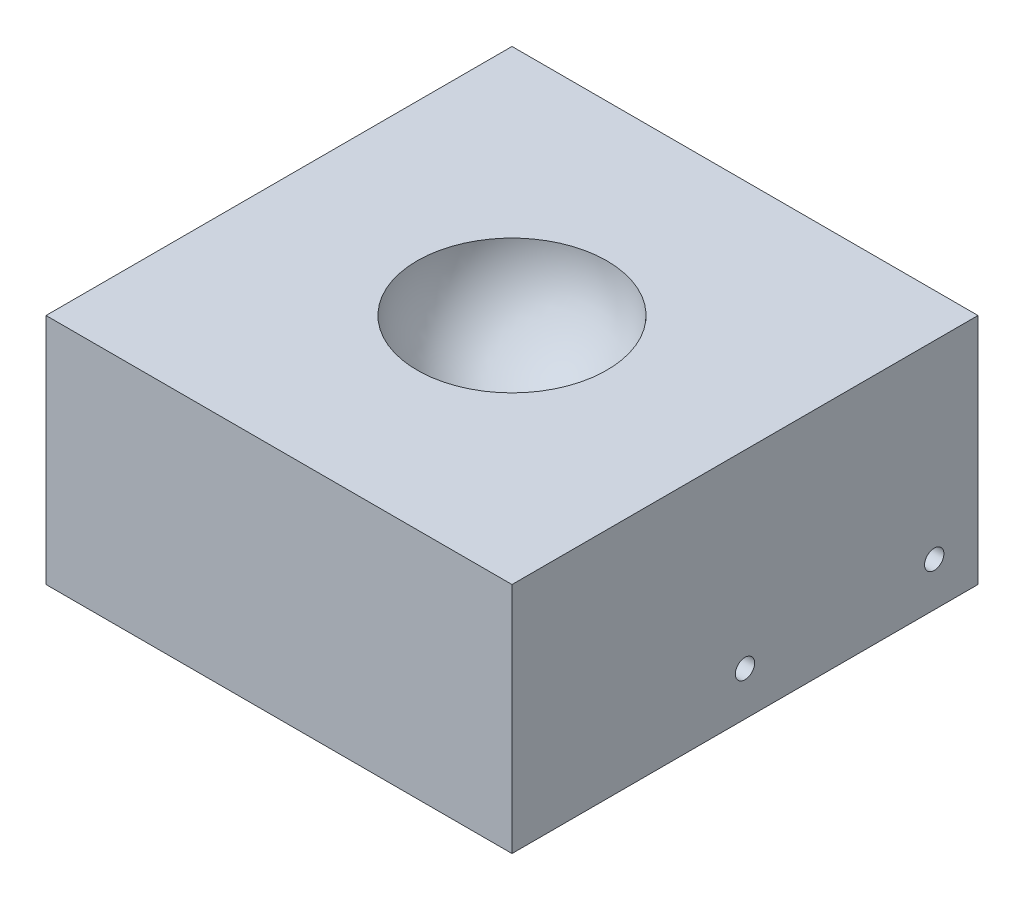
ISO-10303-21;
HEADER;
FILE_DESCRIPTION(('STEP AP214'),'2;1');
FILE_NAME('part.step','',(''),(''),'','','');
FILE_SCHEMA(('AUTOMOTIVE_DESIGN { 1 0 10303 214 1 1 1 1 }'));
ENDSEC;
DATA;
#1=APPLICATION_CONTEXT('core data for automotive mechanical design processes');
#2=APPLICATION_PROTOCOL_DEFINITION('international standard','automotive_design',2000,#1);
#3=PRODUCT_CONTEXT('',#1,'mechanical');
#4=PRODUCT('Part','Part','',(#3));
#5=PRODUCT_RELATED_PRODUCT_CATEGORY('part','',(#4));
#6=PRODUCT_DEFINITION_FORMATION('','',#4);
#7=PRODUCT_DEFINITION_CONTEXT('part definition',#1,'design');
#8=PRODUCT_DEFINITION('design','',#6,#7);
#9=PRODUCT_DEFINITION_SHAPE('','',#8);
#10=(LENGTH_UNIT() NAMED_UNIT(*) SI_UNIT(.MILLI.,.METRE.));
#11=(NAMED_UNIT(*) PLANE_ANGLE_UNIT() SI_UNIT($,.RADIAN.));
#12=(NAMED_UNIT(*) SI_UNIT($,.STERADIAN.) SOLID_ANGLE_UNIT());
#13=UNCERTAINTY_MEASURE_WITH_UNIT(LENGTH_MEASURE(1.E-05),#10,'distance_accuracy_value','');
#14=(GEOMETRIC_REPRESENTATION_CONTEXT(3) GLOBAL_UNCERTAINTY_ASSIGNED_CONTEXT((#13)) GLOBAL_UNIT_ASSIGNED_CONTEXT((#10,
#11,#12)) REPRESENTATION_CONTEXT('',''));
#15=CARTESIAN_POINT('',(0.,0.,0.));
#16=DIRECTION('',(0.,0.,1.));
#17=DIRECTION('',(1.,0.,0.));
#18=AXIS2_PLACEMENT_3D('',#15,#16,#17);
#19=CARTESIAN_POINT('',(86.,-86.,86.));
#20=DIRECTION('',(1.,0.,0.));
#21=DIRECTION('',(0.,0.,-1.));
#22=AXIS2_PLACEMENT_3D('',#19,#20,#21);
#23=PLANE('',#22);
#24=CARTESIAN_POINT('',(86.,-69.85,-69.85));
#25=DIRECTION('',(1.,0.,0.));
#26=DIRECTION('',(0.,0.,-1.));
#27=AXIS2_PLACEMENT_3D('',#24,#25,#26);
#28=CIRCLE('',#27,3.56870000000001);
#29=CARTESIAN_POINT('',(86.,-69.85,-73.4187));
#30=VERTEX_POINT('',#29);
#31=EDGE_CURVE('E150',#30,#30,#28,.T.);
#32=ORIENTED_EDGE('',*,*,#31,.F.);
#33=EDGE_LOOP('',(#32));
#34=FACE_BOUND('',#33,.T.);
#35=CARTESIAN_POINT('',(86.,-69.85,0.));
#36=DIRECTION('',(1.,0.,0.));
#37=DIRECTION('',(0.,0.,-1.));
#38=AXIS2_PLACEMENT_3D('',#35,#36,#37);
#39=CIRCLE('',#38,3.56870000000001);
#40=CARTESIAN_POINT('',(86.,-69.85,-3.56870000000001));
#41=VERTEX_POINT('',#40);
#42=EDGE_CURVE('E152',#41,#41,#39,.T.);
#43=ORIENTED_EDGE('',*,*,#42,.F.);
#44=EDGE_LOOP('',(#43));
#45=FACE_BOUND('',#44,.T.);
#46=DIRECTION('',(0.,0.,-1.));
#47=VECTOR('',#46,1.);
#48=CARTESIAN_POINT('',(86.,0.,86.));
#49=LINE('',#48,#47);
#50=CARTESIAN_POINT('',(86.,0.,86.));
#51=VERTEX_POINT('',#50);
#52=CARTESIAN_POINT('',(86.,0.,-86.));
#53=VERTEX_POINT('',#52);
#54=EDGE_CURVE('E97',#51,#53,#49,.T.);
#55=ORIENTED_EDGE('',*,*,#54,.F.);
#56=DIRECTION('',(0.,1.,0.));
#57=VECTOR('',#56,1.);
#58=CARTESIAN_POINT('',(86.,-86.,86.));
#59=LINE('',#58,#57);
#60=CARTESIAN_POINT('',(86.,-86.,86.));
#61=VERTEX_POINT('',#60);
#62=EDGE_CURVE('E11',#61,#51,#59,.T.);
#63=ORIENTED_EDGE('',*,*,#62,.F.);
#64=DIRECTION('',(0.,0.,-1.));
#65=VECTOR('',#64,1.);
#66=CARTESIAN_POINT('',(86.,-86.,86.));
#67=LINE('',#66,#65);
#68=CARTESIAN_POINT('',(86.,-86.,-86.));
#69=VERTEX_POINT('',#68);
#70=EDGE_CURVE('E90',#61,#69,#67,.T.);
#71=ORIENTED_EDGE('',*,*,#70,.T.);
#72=DIRECTION('',(0.,1.,0.));
#73=VECTOR('',#72,1.);
#74=CARTESIAN_POINT('',(86.,-86.,-86.));
#75=LINE('',#74,#73);
#76=EDGE_CURVE('E35',#69,#53,#75,.T.);
#77=ORIENTED_EDGE('',*,*,#76,.T.);
#78=EDGE_LOOP('',(#55,#63,#71,#77));
#79=FACE_BOUND('',#78,.T.);
#80=ADVANCED_FACE('F32',(#34,#45,#79),#23,.T.);
#81=CARTESIAN_POINT('',(-86.,-86.,86.));
#82=DIRECTION('',(0.,0.,1.));
#83=DIRECTION('',(1.,0.,0.));
#84=AXIS2_PLACEMENT_3D('',#81,#82,#83);
#85=PLANE('',#84);
#86=DIRECTION('',(1.,0.,0.));
#87=VECTOR('',#86,1.);
#88=CARTESIAN_POINT('',(-86.,0.,86.));
#89=LINE('',#88,#87);
#90=CARTESIAN_POINT('',(-86.,0.,86.));
#91=VERTEX_POINT('',#90);
#92=EDGE_CURVE('E92',#91,#51,#89,.T.);
#93=ORIENTED_EDGE('',*,*,#92,.F.);
#94=DIRECTION('',(0.,1.,0.));
#95=VECTOR('',#94,1.);
#96=CARTESIAN_POINT('',(-86.,-86.,86.));
#97=LINE('',#96,#95);
#98=CARTESIAN_POINT('',(-86.,-86.,86.));
#99=VERTEX_POINT('',#98);
#100=EDGE_CURVE('E41',#99,#91,#97,.T.);
#101=ORIENTED_EDGE('',*,*,#100,.F.);
#102=DIRECTION('',(1.,0.,0.));
#103=VECTOR('',#102,1.);
#104=CARTESIAN_POINT('',(-86.,-86.,86.));
#105=LINE('',#104,#103);
#106=EDGE_CURVE('E87',#99,#61,#105,.T.);
#107=ORIENTED_EDGE('',*,*,#106,.T.);
#108=ORIENTED_EDGE('',*,*,#62,.T.);
#109=EDGE_LOOP('',(#93,#101,#107,#108));
#110=FACE_BOUND('',#109,.T.);
#111=ADVANCED_FACE('F108',(#110),#85,.T.);
#112=CARTESIAN_POINT('',(-86.,-86.,86.));
#113=DIRECTION('',(-1.,0.,0.));
#114=DIRECTION('',(0.,0.,1.));
#115=AXIS2_PLACEMENT_3D('',#112,#113,#114);
#116=PLANE('',#115);
#117=CARTESIAN_POINT('',(-86.,-69.85,-69.85));
#118=DIRECTION('',(1.,0.,0.));
#119=DIRECTION('',(0.,0.,-1.));
#120=AXIS2_PLACEMENT_3D('',#117,#118,#119);
#121=CIRCLE('',#120,3.56870000000001);
#122=CARTESIAN_POINT('',(-86.,-69.85,-73.4187));
#123=VERTEX_POINT('',#122);
#124=EDGE_CURVE('E147',#123,#123,#121,.T.);
#125=ORIENTED_EDGE('',*,*,#124,.T.);
#126=EDGE_LOOP('',(#125));
#127=FACE_BOUND('',#126,.T.);
#128=CARTESIAN_POINT('',(-86.,-69.85,0.));
#129=DIRECTION('',(1.,0.,0.));
#130=DIRECTION('',(0.,0.,-1.));
#131=AXIS2_PLACEMENT_3D('',#128,#129,#130);
#132=CIRCLE('',#131,3.56870000000001);
#133=CARTESIAN_POINT('',(-86.,-69.85,-3.56870000000001));
#134=VERTEX_POINT('',#133);
#135=EDGE_CURVE('E157',#134,#134,#132,.T.);
#136=ORIENTED_EDGE('',*,*,#135,.T.);
#137=EDGE_LOOP('',(#136));
#138=FACE_BOUND('',#137,.T.);
#139=DIRECTION('',(0.,0.,1.));
#140=VECTOR('',#139,1.);
#141=CARTESIAN_POINT('',(-86.,0.,86.));
#142=LINE('',#141,#140);
#143=CARTESIAN_POINT('',(-86.,0.,-86.));
#144=VERTEX_POINT('',#143);
#145=EDGE_CURVE('E82',#144,#91,#142,.T.);
#146=ORIENTED_EDGE('',*,*,#145,.F.);
#147=DIRECTION('',(0.,1.,0.));
#148=VECTOR('',#147,1.);
#149=CARTESIAN_POINT('',(-86.,-86.,-86.));
#150=LINE('',#149,#148);
#151=CARTESIAN_POINT('',(-86.,-86.,-86.));
#152=VERTEX_POINT('',#151);
#153=EDGE_CURVE('E77',#152,#144,#150,.T.);
#154=ORIENTED_EDGE('',*,*,#153,.F.);
#155=DIRECTION('',(0.,0.,1.));
#156=VECTOR('',#155,1.);
#157=CARTESIAN_POINT('',(-86.,-86.,86.));
#158=LINE('',#157,#156);
#159=EDGE_CURVE('E80',#152,#99,#158,.T.);
#160=ORIENTED_EDGE('',*,*,#159,.T.);
#161=ORIENTED_EDGE('',*,*,#100,.T.);
#162=EDGE_LOOP('',(#146,#154,#160,#161));
#163=FACE_BOUND('',#162,.T.);
#164=ADVANCED_FACE('F79',(#127,#138,#163),#116,.T.);
#165=CARTESIAN_POINT('',(-86.,-86.,-86.));
#166=DIRECTION('',(0.,0.,-1.));
#167=DIRECTION('',(-1.,0.,0.));
#168=AXIS2_PLACEMENT_3D('',#165,#166,#167);
#169=PLANE('',#168);
#170=DIRECTION('',(-1.,0.,0.));
#171=VECTOR('',#170,1.);
#172=CARTESIAN_POINT('',(-86.,0.,-86.));
#173=LINE('',#172,#171);
#174=EDGE_CURVE('E100',#53,#144,#173,.T.);
#175=ORIENTED_EDGE('',*,*,#174,.F.);
#176=ORIENTED_EDGE('',*,*,#76,.F.);
#177=DIRECTION('',(-1.,0.,0.));
#178=VECTOR('',#177,1.);
#179=CARTESIAN_POINT('',(-86.,-86.,-86.));
#180=LINE('',#179,#178);
#181=EDGE_CURVE('E86',#69,#152,#180,.T.);
#182=ORIENTED_EDGE('',*,*,#181,.T.);
#183=ORIENTED_EDGE('',*,*,#153,.T.);
#184=EDGE_LOOP('',(#175,#176,#182,#183));
#185=FACE_BOUND('',#184,.T.);
#186=ADVANCED_FACE('F89',(#185),#169,.T.);
#187=CARTESIAN_POINT('',(0.,-86.,0.));
#188=DIRECTION('',(0.,-1.,0.));
#189=DIRECTION('',(0.,0.,-1.));
#190=AXIS2_PLACEMENT_3D('',#187,#188,#189);
#191=PLANE('',#190);
#192=ORIENTED_EDGE('',*,*,#70,.F.);
#193=ORIENTED_EDGE('',*,*,#106,.F.);
#194=ORIENTED_EDGE('',*,*,#159,.F.);
#195=ORIENTED_EDGE('',*,*,#181,.F.);
#196=EDGE_LOOP('',(#192,#193,#194,#195));
#197=FACE_BOUND('',#196,.T.);
#198=ADVANCED_FACE('F85',(#197),#191,.T.);
#199=CARTESIAN_POINT('',(0.,0.,0.));
#200=DIRECTION('',(0.,-1.,0.));
#201=DIRECTION('',(0.,0.,-1.));
#202=AXIS2_PLACEMENT_3D('',#199,#200,#201);
#203=PLANE('',#202);
#204=CARTESIAN_POINT('',(0.,0.,0.));
#205=DIRECTION('',(0.,-1.,0.));
#206=DIRECTION('',(0.,0.,-1.));
#207=AXIS2_PLACEMENT_3D('',#204,#205,#206);
#208=CIRCLE('',#207,35.);
#209=CARTESIAN_POINT('',(0.,0.,-35.));
#210=VERTEX_POINT('',#209);
#211=EDGE_CURVE('E101',#210,#210,#208,.T.);
#212=ORIENTED_EDGE('',*,*,#211,.T.);
#213=EDGE_LOOP('',(#212));
#214=FACE_BOUND('',#213,.T.);
#215=ORIENTED_EDGE('',*,*,#54,.T.);
#216=ORIENTED_EDGE('',*,*,#174,.T.);
#217=ORIENTED_EDGE('',*,*,#145,.T.);
#218=ORIENTED_EDGE('',*,*,#92,.T.);
#219=EDGE_LOOP('',(#215,#216,#217,#218));
#220=FACE_BOUND('',#219,.T.);
#221=ADVANCED_FACE('F107',(#214,#220),#203,.F.);
#222=CARTESIAN_POINT('',(0.,0.,0.));
#223=DIRECTION('',(0.,-1.,0.));
#224=DIRECTION('',(-1.,0.,0.));
#225=AXIS2_PLACEMENT_3D('',#222,#223,#224);
#226=SPHERICAL_SURFACE('',#225,35.);
#227=ORIENTED_EDGE('',*,*,#211,.F.);
#228=EDGE_LOOP('',(#227));
#229=FACE_BOUND('',#228,.T.);
#230=ADVANCED_FACE('F129',(#229),#226,.F.);
#231=CARTESIAN_POINT('',(-86.,-69.85,0.));
#232=DIRECTION('',(1.,0.,0.));
#233=DIRECTION('',(0.,0.,-1.));
#234=AXIS2_PLACEMENT_3D('',#231,#232,#233);
#235=CYLINDRICAL_SURFACE('',#234,3.56870000000001);
#236=ORIENTED_EDGE('',*,*,#135,.F.);
#237=EDGE_LOOP('',(#236));
#238=FACE_BOUND('',#237,.T.);
#239=ORIENTED_EDGE('',*,*,#42,.T.);
#240=EDGE_LOOP('',(#239));
#241=FACE_BOUND('',#240,.T.);
#242=ADVANCED_FACE('F134',(#238,#241),#235,.F.);
#243=CARTESIAN_POINT('',(-86.,-69.85,-69.85));
#244=DIRECTION('',(1.,0.,0.));
#245=DIRECTION('',(0.,0.,-1.));
#246=AXIS2_PLACEMENT_3D('',#243,#244,#245);
#247=CYLINDRICAL_SURFACE('',#246,3.56870000000001);
#248=ORIENTED_EDGE('',*,*,#124,.F.);
#249=EDGE_LOOP('',(#248));
#250=FACE_BOUND('',#249,.T.);
#251=ORIENTED_EDGE('',*,*,#31,.T.);
#252=EDGE_LOOP('',(#251));
#253=FACE_BOUND('',#252,.T.);
#254=ADVANCED_FACE('F138',(#250,#253),#247,.F.);
#255=CLOSED_SHELL('',(#80,#111,#164,#186,#198,#221,#230,#242,#254));
#256=MANIFOLD_SOLID_BREP('B2',#255);
#257=ADVANCED_BREP_SHAPE_REPRESENTATION('',(#18,#256),#14);
#258=SHAPE_DEFINITION_REPRESENTATION(#9,#257);
ENDSEC;
END-ISO-10303-21;
